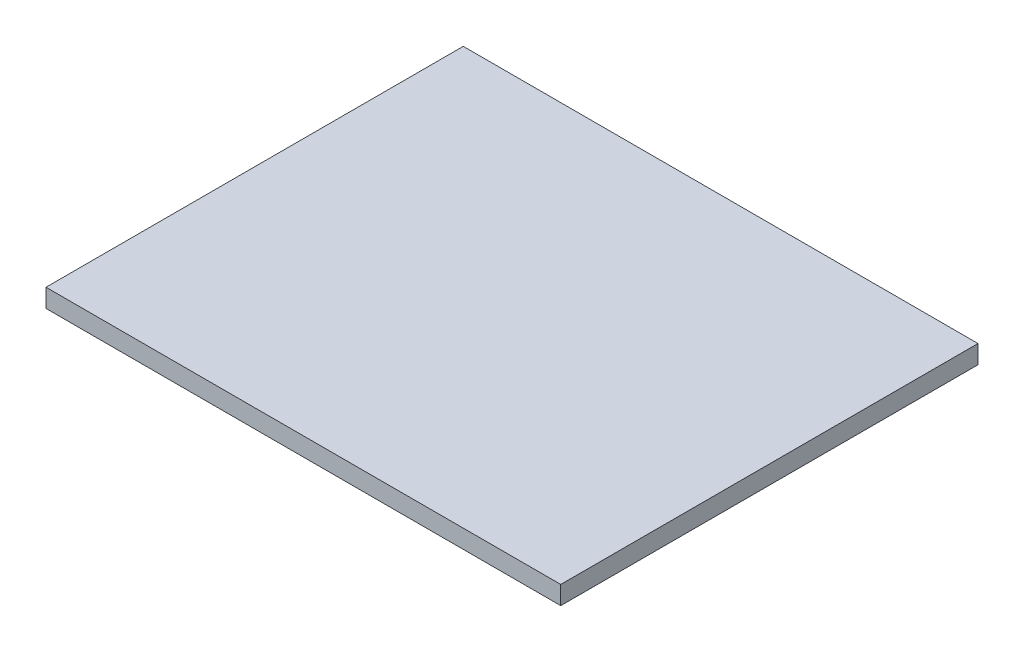
ISO-10303-21;
HEADER;
FILE_DESCRIPTION(('STEP AP214'),'2;1');
FILE_NAME('part.step','',(''),(''),'','','');
FILE_SCHEMA(('AUTOMOTIVE_DESIGN { 1 0 10303 214 1 1 1 1 }'));
ENDSEC;
DATA;
#1=APPLICATION_CONTEXT('core data for automotive mechanical design processes');
#2=APPLICATION_PROTOCOL_DEFINITION('international standard','automotive_design',2000,#1);
#3=PRODUCT_CONTEXT('',#1,'mechanical');
#4=PRODUCT('Part','Part','',(#3));
#5=PRODUCT_RELATED_PRODUCT_CATEGORY('part','',(#4));
#6=PRODUCT_DEFINITION_FORMATION('','',#4);
#7=PRODUCT_DEFINITION_CONTEXT('part definition',#1,'design');
#8=PRODUCT_DEFINITION('design','',#6,#7);
#9=PRODUCT_DEFINITION_SHAPE('','',#8);
#10=(LENGTH_UNIT() NAMED_UNIT(*) SI_UNIT(.MILLI.,.METRE.));
#11=(NAMED_UNIT(*) PLANE_ANGLE_UNIT() SI_UNIT($,.RADIAN.));
#12=(NAMED_UNIT(*) SI_UNIT($,.STERADIAN.) SOLID_ANGLE_UNIT());
#13=UNCERTAINTY_MEASURE_WITH_UNIT(LENGTH_MEASURE(1.E-05),#10,'distance_accuracy_value','');
#14=(GEOMETRIC_REPRESENTATION_CONTEXT(3) GLOBAL_UNCERTAINTY_ASSIGNED_CONTEXT((#13)) GLOBAL_UNIT_ASSIGNED_CONTEXT((#10,
#11,#12)) REPRESENTATION_CONTEXT('',''));
#15=CARTESIAN_POINT('',(0.,0.,0.));
#16=DIRECTION('',(0.,0.,1.));
#17=DIRECTION('',(1.,0.,0.));
#18=AXIS2_PLACEMENT_3D('',#15,#16,#17);
#19=CARTESIAN_POINT('',(0.,3.,0.));
#20=DIRECTION('',(1.,0.,0.));
#21=DIRECTION('',(0.,0.,-1.));
#22=AXIS2_PLACEMENT_3D('',#19,#20,#21);
#23=PLANE('',#22);
#24=DIRECTION('',(0.,0.,1.));
#25=VECTOR('',#24,1.);
#26=CARTESIAN_POINT('',(0.,0.,0.));
#27=LINE('',#26,#25);
#28=CARTESIAN_POINT('',(0.,0.,-68.0247829523585));
#29=VERTEX_POINT('',#28);
#30=CARTESIAN_POINT('',(0.,0.,0.));
#31=VERTEX_POINT('',#30);
#32=EDGE_CURVE('E96',#29,#31,#27,.T.);
#33=ORIENTED_EDGE('',*,*,#32,.T.);
#34=DIRECTION('',(0.,-1.,0.));
#35=VECTOR('',#34,1.);
#36=CARTESIAN_POINT('',(0.,3.,0.));
#37=LINE('',#36,#35);
#38=CARTESIAN_POINT('',(0.,3.,0.));
#39=VERTEX_POINT('',#38);
#40=EDGE_CURVE('E11',#39,#31,#37,.T.);
#41=ORIENTED_EDGE('',*,*,#40,.F.);
#42=DIRECTION('',(0.,0.,1.));
#43=VECTOR('',#42,1.);
#44=CARTESIAN_POINT('',(0.,3.,0.));
#45=LINE('',#44,#43);
#46=CARTESIAN_POINT('',(0.,3.,-68.0247829523585));
#47=VERTEX_POINT('',#46);
#48=EDGE_CURVE('E84',#47,#39,#45,.T.);
#49=ORIENTED_EDGE('',*,*,#48,.F.);
#50=DIRECTION('',(0.,-1.,0.));
#51=VECTOR('',#50,1.);
#52=CARTESIAN_POINT('',(0.,3.,-68.0247829523585));
#53=LINE('',#52,#51);
#54=EDGE_CURVE('E92',#47,#29,#53,.T.);
#55=ORIENTED_EDGE('',*,*,#54,.T.);
#56=EDGE_LOOP('',(#33,#41,#49,#55));
#57=FACE_BOUND('',#56,.T.);
#58=ADVANCED_FACE('F33',(#57),#23,.F.);
#59=CARTESIAN_POINT('',(0.,3.,0.));
#60=DIRECTION('',(0.,0.,-1.));
#61=DIRECTION('',(-1.,0.,0.));
#62=AXIS2_PLACEMENT_3D('',#59,#60,#61);
#63=PLANE('',#62);
#64=DIRECTION('',(1.,0.,0.));
#65=VECTOR('',#64,1.);
#66=CARTESIAN_POINT('',(0.,0.,0.));
#67=LINE('',#66,#65);
#68=CARTESIAN_POINT('',(83.9191934969168,0.,0.));
#69=VERTEX_POINT('',#68);
#70=EDGE_CURVE('E88',#31,#69,#67,.T.);
#71=ORIENTED_EDGE('',*,*,#70,.T.);
#72=DIRECTION('',(0.,-1.,0.));
#73=VECTOR('',#72,1.);
#74=CARTESIAN_POINT('',(83.9191934969168,3.,0.));
#75=LINE('',#74,#73);
#76=CARTESIAN_POINT('',(83.9191934969168,3.,0.));
#77=VERTEX_POINT('',#76);
#78=EDGE_CURVE('E41',#77,#69,#75,.T.);
#79=ORIENTED_EDGE('',*,*,#78,.F.);
#80=DIRECTION('',(1.,0.,0.));
#81=VECTOR('',#80,1.);
#82=CARTESIAN_POINT('',(0.,3.,0.));
#83=LINE('',#82,#81);
#84=EDGE_CURVE('E79',#39,#77,#83,.T.);
#85=ORIENTED_EDGE('',*,*,#84,.F.);
#86=ORIENTED_EDGE('',*,*,#40,.T.);
#87=EDGE_LOOP('',(#71,#79,#85,#86));
#88=FACE_BOUND('',#87,.T.);
#89=ADVANCED_FACE('F87',(#88),#63,.F.);
#90=CARTESIAN_POINT('',(83.9191934969168,3.,0.));
#91=DIRECTION('',(-1.,0.,0.));
#92=DIRECTION('',(0.,0.,1.));
#93=AXIS2_PLACEMENT_3D('',#90,#91,#92);
#94=PLANE('',#93);
#95=DIRECTION('',(0.,0.,-1.));
#96=VECTOR('',#95,1.);
#97=CARTESIAN_POINT('',(83.9191934969168,0.,0.));
#98=LINE('',#97,#96);
#99=CARTESIAN_POINT('',(83.9191934969168,0.,-68.0247829523585));
#100=VERTEX_POINT('',#99);
#101=EDGE_CURVE('E66',#69,#100,#98,.T.);
#102=ORIENTED_EDGE('',*,*,#101,.T.);
#103=DIRECTION('',(0.,-1.,0.));
#104=VECTOR('',#103,1.);
#105=CARTESIAN_POINT('',(83.9191934969168,3.,-68.0247829523585));
#106=LINE('',#105,#104);
#107=CARTESIAN_POINT('',(83.9191934969168,3.,-68.0247829523585));
#108=VERTEX_POINT('',#107);
#109=EDGE_CURVE('E89',#108,#100,#106,.T.);
#110=ORIENTED_EDGE('',*,*,#109,.F.);
#111=DIRECTION('',(0.,0.,-1.));
#112=VECTOR('',#111,1.);
#113=CARTESIAN_POINT('',(83.9191934969168,3.,0.));
#114=LINE('',#113,#112);
#115=EDGE_CURVE('E82',#77,#108,#114,.T.);
#116=ORIENTED_EDGE('',*,*,#115,.F.);
#117=ORIENTED_EDGE('',*,*,#78,.T.);
#118=EDGE_LOOP('',(#102,#110,#116,#117));
#119=FACE_BOUND('',#118,.T.);
#120=ADVANCED_FACE('F90',(#119),#94,.F.);
#121=CARTESIAN_POINT('',(0.,3.,-68.0247829523585));
#122=DIRECTION('',(0.,0.,1.));
#123=DIRECTION('',(1.,0.,0.));
#124=AXIS2_PLACEMENT_3D('',#121,#122,#123);
#125=PLANE('',#124);
#126=DIRECTION('',(-1.,0.,0.));
#127=VECTOR('',#126,1.);
#128=CARTESIAN_POINT('',(0.,0.,-68.0247829523585));
#129=LINE('',#128,#127);
#130=EDGE_CURVE('E72',#100,#29,#129,.T.);
#131=ORIENTED_EDGE('',*,*,#130,.T.);
#132=ORIENTED_EDGE('',*,*,#54,.F.);
#133=DIRECTION('',(-1.,0.,0.));
#134=VECTOR('',#133,1.);
#135=CARTESIAN_POINT('',(0.,3.,-68.0247829523585));
#136=LINE('',#135,#134);
#137=EDGE_CURVE('E49',#108,#47,#136,.T.);
#138=ORIENTED_EDGE('',*,*,#137,.F.);
#139=ORIENTED_EDGE('',*,*,#109,.T.);
#140=EDGE_LOOP('',(#131,#132,#138,#139));
#141=FACE_BOUND('',#140,.T.);
#142=ADVANCED_FACE('F103',(#141),#125,.F.);
#143=CARTESIAN_POINT('',(0.,3.,0.));
#144=DIRECTION('',(0.,-1.,0.));
#145=DIRECTION('',(0.,0.,-1.));
#146=AXIS2_PLACEMENT_3D('',#143,#144,#145);
#147=PLANE('',#146);
#148=ORIENTED_EDGE('',*,*,#48,.T.);
#149=ORIENTED_EDGE('',*,*,#84,.T.);
#150=ORIENTED_EDGE('',*,*,#115,.T.);
#151=ORIENTED_EDGE('',*,*,#137,.T.);
#152=EDGE_LOOP('',(#148,#149,#150,#151));
#153=FACE_BOUND('',#152,.T.);
#154=ADVANCED_FACE('F80',(#153),#147,.F.);
#155=CARTESIAN_POINT('',(0.,0.,0.));
#156=DIRECTION('',(0.,-1.,0.));
#157=DIRECTION('',(0.,0.,-1.));
#158=AXIS2_PLACEMENT_3D('',#155,#156,#157);
#159=PLANE('',#158);
#160=ORIENTED_EDGE('',*,*,#32,.F.);
#161=ORIENTED_EDGE('',*,*,#130,.F.);
#162=ORIENTED_EDGE('',*,*,#101,.F.);
#163=ORIENTED_EDGE('',*,*,#70,.F.);
#164=EDGE_LOOP('',(#160,#161,#162,#163));
#165=FACE_BOUND('',#164,.T.);
#166=ADVANCED_FACE('F106',(#165),#159,.T.);
#167=CLOSED_SHELL('',(#58,#89,#120,#142,#154,#166));
#168=MANIFOLD_SOLID_BREP('B2',#167);
#169=ADVANCED_BREP_SHAPE_REPRESENTATION('',(#18,#168),#14);
#170=SHAPE_DEFINITION_REPRESENTATION(#9,#169);
ENDSEC;
END-ISO-10303-21;
